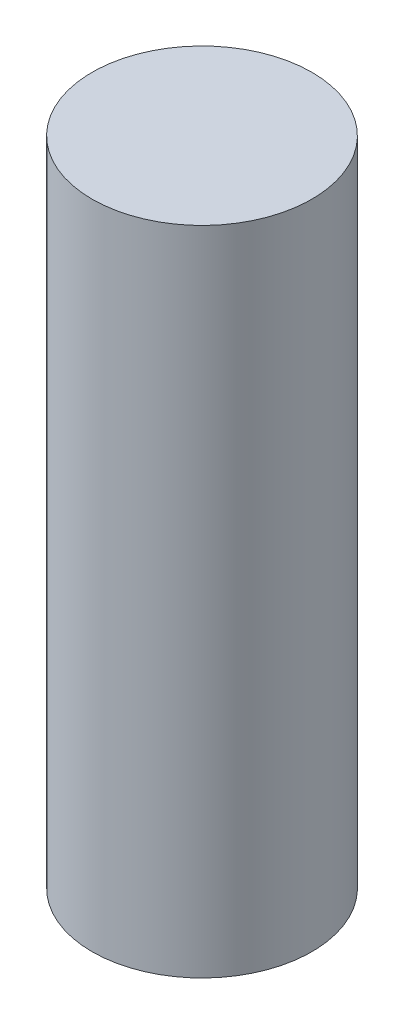
ISO-10303-21;
HEADER;
FILE_DESCRIPTION(('STEP AP214'),'2;1');
FILE_NAME('part.step','',(''),(''),'','','');
FILE_SCHEMA(('AUTOMOTIVE_DESIGN { 1 0 10303 214 1 1 1 1 }'));
ENDSEC;
DATA;
#1=APPLICATION_CONTEXT('core data for automotive mechanical design processes');
#2=APPLICATION_PROTOCOL_DEFINITION('international standard','automotive_design',2000,#1);
#3=PRODUCT_CONTEXT('',#1,'mechanical');
#4=PRODUCT('Part','Part','',(#3));
#5=PRODUCT_RELATED_PRODUCT_CATEGORY('part','',(#4));
#6=PRODUCT_DEFINITION_FORMATION('','',#4);
#7=PRODUCT_DEFINITION_CONTEXT('part definition',#1,'design');
#8=PRODUCT_DEFINITION('design','',#6,#7);
#9=PRODUCT_DEFINITION_SHAPE('','',#8);
#10=(LENGTH_UNIT() NAMED_UNIT(*) SI_UNIT(.MILLI.,.METRE.));
#11=(NAMED_UNIT(*) PLANE_ANGLE_UNIT() SI_UNIT($,.RADIAN.));
#12=(NAMED_UNIT(*) SI_UNIT($,.STERADIAN.) SOLID_ANGLE_UNIT());
#13=UNCERTAINTY_MEASURE_WITH_UNIT(LENGTH_MEASURE(1.E-05),#10,'distance_accuracy_value','');
#14=(GEOMETRIC_REPRESENTATION_CONTEXT(3) GLOBAL_UNCERTAINTY_ASSIGNED_CONTEXT((#13)) GLOBAL_UNIT_ASSIGNED_CONTEXT((#10,
#11,#12)) REPRESENTATION_CONTEXT('',''));
#15=CARTESIAN_POINT('',(0.,0.,0.));
#16=DIRECTION('',(0.,0.,1.));
#17=DIRECTION('',(1.,0.,0.));
#18=AXIS2_PLACEMENT_3D('',#15,#16,#17);
#19=CARTESIAN_POINT('',(0.,42.0116,0.));
#20=DIRECTION('',(0.,-1.,0.));
#21=DIRECTION('',(0.,0.,-1.));
#22=AXIS2_PLACEMENT_3D('',#19,#20,#21);
#23=CYLINDRICAL_SURFACE('',#22,7.085);
#24=CARTESIAN_POINT('',(0.,42.0116,0.));
#25=DIRECTION('',(0.,1.,0.));
#26=DIRECTION('',(0.,0.,1.));
#27=AXIS2_PLACEMENT_3D('',#24,#25,#26);
#28=CIRCLE('',#27,7.085);
#29=CARTESIAN_POINT('',(0.,42.0116,7.085));
#30=VERTEX_POINT('',#29);
#31=EDGE_CURVE('E10',#30,#30,#28,.T.);
#32=ORIENTED_EDGE('',*,*,#31,.F.);
#33=EDGE_LOOP('',(#32));
#34=FACE_BOUND('',#33,.T.);
#35=CARTESIAN_POINT('',(0.,0.,0.));
#36=DIRECTION('',(0.,1.,0.));
#37=DIRECTION('',(0.,0.,1.));
#38=AXIS2_PLACEMENT_3D('',#35,#36,#37);
#39=CIRCLE('',#38,7.085);
#40=CARTESIAN_POINT('',(0.,0.,7.085));
#41=VERTEX_POINT('',#40);
#42=EDGE_CURVE('E34',#41,#41,#39,.T.);
#43=ORIENTED_EDGE('',*,*,#42,.T.);
#44=EDGE_LOOP('',(#43));
#45=FACE_BOUND('',#44,.T.);
#46=ADVANCED_FACE('F31',(#34,#45),#23,.T.);
#47=CARTESIAN_POINT('',(0.,42.0116,0.));
#48=DIRECTION('',(0.,1.,0.));
#49=DIRECTION('',(0.,0.,1.));
#50=AXIS2_PLACEMENT_3D('',#47,#48,#49);
#51=PLANE('',#50);
#52=ORIENTED_EDGE('',*,*,#31,.T.);
#53=EDGE_LOOP('',(#52));
#54=FACE_BOUND('',#53,.T.);
#55=ADVANCED_FACE('F46',(#54),#51,.T.);
#56=CARTESIAN_POINT('',(0.,0.,0.));
#57=DIRECTION('',(0.,1.,0.));
#58=DIRECTION('',(0.,0.,1.));
#59=AXIS2_PLACEMENT_3D('',#56,#57,#58);
#60=PLANE('',#59);
#61=ORIENTED_EDGE('',*,*,#42,.F.);
#62=EDGE_LOOP('',(#61));
#63=FACE_BOUND('',#62,.T.);
#64=ADVANCED_FACE('F44',(#63),#60,.F.);
#65=CLOSED_SHELL('',(#46,#55,#64));
#66=MANIFOLD_SOLID_BREP('B2',#65);
#67=ADVANCED_BREP_SHAPE_REPRESENTATION('',(#18,#66),#14);
#68=SHAPE_DEFINITION_REPRESENTATION(#9,#67);
ENDSEC;
END-ISO-10303-21;
